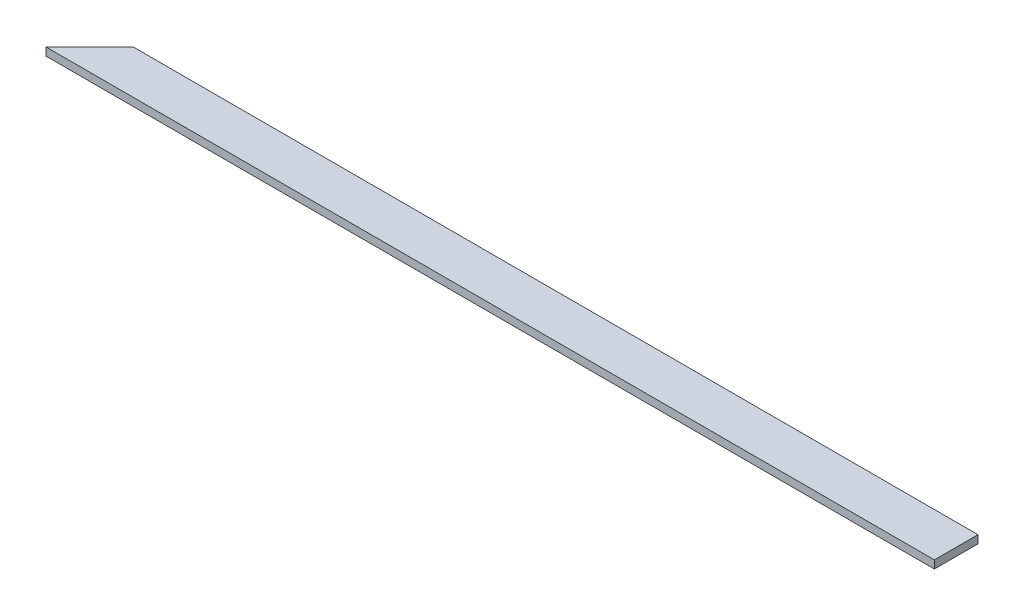
ISO-10303-21;
HEADER;
FILE_DESCRIPTION(('STEP AP214'),'2;1');
FILE_NAME('part.step','',(''),(''),'','','');
FILE_SCHEMA(('AUTOMOTIVE_DESIGN { 1 0 10303 214 1 1 1 1 }'));
ENDSEC;
DATA;
#1=APPLICATION_CONTEXT('core data for automotive mechanical design processes');
#2=APPLICATION_PROTOCOL_DEFINITION('international standard','automotive_design',2000,#1);
#3=PRODUCT_CONTEXT('',#1,'mechanical');
#4=PRODUCT('Part','Part','',(#3));
#5=PRODUCT_RELATED_PRODUCT_CATEGORY('part','',(#4));
#6=PRODUCT_DEFINITION_FORMATION('','',#4);
#7=PRODUCT_DEFINITION_CONTEXT('part definition',#1,'design');
#8=PRODUCT_DEFINITION('design','',#6,#7);
#9=PRODUCT_DEFINITION_SHAPE('','',#8);
#10=(LENGTH_UNIT() NAMED_UNIT(*) SI_UNIT(.MILLI.,.METRE.));
#11=(NAMED_UNIT(*) PLANE_ANGLE_UNIT() SI_UNIT($,.RADIAN.));
#12=(NAMED_UNIT(*) SI_UNIT($,.STERADIAN.) SOLID_ANGLE_UNIT());
#13=UNCERTAINTY_MEASURE_WITH_UNIT(LENGTH_MEASURE(1.E-05),#10,'distance_accuracy_value','');
#14=(GEOMETRIC_REPRESENTATION_CONTEXT(3) GLOBAL_UNCERTAINTY_ASSIGNED_CONTEXT((#13)) GLOBAL_UNIT_ASSIGNED_CONTEXT((#10,
#11,#12)) REPRESENTATION_CONTEXT('',''));
#15=CARTESIAN_POINT('',(0.,0.,0.));
#16=DIRECTION('',(0.,0.,1.));
#17=DIRECTION('',(1.,0.,0.));
#18=AXIS2_PLACEMENT_3D('',#15,#16,#17);
#19=CARTESIAN_POINT('',(2844.8,25.4,0.));
#20=DIRECTION('',(-1.,0.,0.));
#21=DIRECTION('',(0.,0.,1.));
#22=AXIS2_PLACEMENT_3D('',#19,#20,#21);
#23=PLANE('',#22);
#24=DIRECTION('',(0.,0.,-1.));
#25=VECTOR('',#24,1.);
#26=CARTESIAN_POINT('',(2844.8,0.,0.));
#27=LINE('',#26,#25);
#28=CARTESIAN_POINT('',(2844.8,0.,0.));
#29=VERTEX_POINT('',#28);
#30=CARTESIAN_POINT('',(2844.8,0.,-139.7));
#31=VERTEX_POINT('',#30);
#32=EDGE_CURVE('E95',#29,#31,#27,.T.);
#33=ORIENTED_EDGE('',*,*,#32,.T.);
#34=DIRECTION('',(0.,-1.,0.));
#35=VECTOR('',#34,1.);
#36=CARTESIAN_POINT('',(2844.8,25.4,-139.7));
#37=LINE('',#36,#35);
#38=CARTESIAN_POINT('',(2844.8,25.4,-139.7));
#39=VERTEX_POINT('',#38);
#40=EDGE_CURVE('E11',#39,#31,#37,.T.);
#41=ORIENTED_EDGE('',*,*,#40,.F.);
#42=DIRECTION('',(0.,0.,-1.));
#43=VECTOR('',#42,1.);
#44=CARTESIAN_POINT('',(2844.8,25.4,0.));
#45=LINE('',#44,#43);
#46=CARTESIAN_POINT('',(2844.8,25.4,0.));
#47=VERTEX_POINT('',#46);
#48=EDGE_CURVE('E80',#47,#39,#45,.T.);
#49=ORIENTED_EDGE('',*,*,#48,.F.);
#50=DIRECTION('',(0.,-1.,0.));
#51=VECTOR('',#50,1.);
#52=CARTESIAN_POINT('',(2844.8,25.4,0.));
#53=LINE('',#52,#51);
#54=EDGE_CURVE('E91',#47,#29,#53,.T.);
#55=ORIENTED_EDGE('',*,*,#54,.T.);
#56=EDGE_LOOP('',(#33,#41,#49,#55));
#57=FACE_BOUND('',#56,.T.);
#58=ADVANCED_FACE('F33',(#57),#23,.F.);
#59=CARTESIAN_POINT('',(0.,25.4,-139.7));
#60=DIRECTION('',(0.,0.,1.));
#61=DIRECTION('',(1.,0.,0.));
#62=AXIS2_PLACEMENT_3D('',#59,#60,#61);
#63=PLANE('',#62);
#64=DIRECTION('',(-1.,0.,0.));
#65=VECTOR('',#64,1.);
#66=CARTESIAN_POINT('',(0.,0.,-139.7));
#67=LINE('',#66,#65);
#68=CARTESIAN_POINT('',(139.699999999999,0.,-139.7));
#69=VERTEX_POINT('',#68);
#70=EDGE_CURVE('E85',#31,#69,#67,.T.);
#71=ORIENTED_EDGE('',*,*,#70,.T.);
#72=DIRECTION('',(0.,-1.,0.));
#73=VECTOR('',#72,1.);
#74=CARTESIAN_POINT('',(139.699999999999,25.4,-139.7));
#75=LINE('',#74,#73);
#76=CARTESIAN_POINT('',(139.699999999999,25.4,-139.7));
#77=VERTEX_POINT('',#76);
#78=EDGE_CURVE('E41',#77,#69,#75,.T.);
#79=ORIENTED_EDGE('',*,*,#78,.F.);
#80=DIRECTION('',(-1.,0.,0.));
#81=VECTOR('',#80,1.);
#82=CARTESIAN_POINT('',(0.,25.4,-139.7));
#83=LINE('',#82,#81);
#84=EDGE_CURVE('E75',#39,#77,#83,.T.);
#85=ORIENTED_EDGE('',*,*,#84,.F.);
#86=ORIENTED_EDGE('',*,*,#40,.T.);
#87=EDGE_LOOP('',(#71,#79,#85,#86));
#88=FACE_BOUND('',#87,.T.);
#89=ADVANCED_FACE('F84',(#88),#63,.F.);
#90=CARTESIAN_POINT('',(0.,25.4,0.));
#91=DIRECTION('',(-0.707106781186549,0.,-0.707106781186546));
#92=DIRECTION('',(-0.707106781186546,0.,0.707106781186549));
#93=AXIS2_PLACEMENT_3D('',#90,#91,#92);
#94=PLANE('',#93);
#95=DIRECTION('',(0.707106781186546,0.,-0.707106781186549));
#96=VECTOR('',#95,1.);
#97=CARTESIAN_POINT('',(0.,0.,0.));
#98=LINE('',#97,#96);
#99=CARTESIAN_POINT('',(0.,0.,0.));
#100=VERTEX_POINT('',#99);
#101=EDGE_CURVE('E99',#100,#69,#98,.T.);
#102=ORIENTED_EDGE('',*,*,#101,.F.);
#103=DIRECTION('',(0.,-1.,0.));
#104=VECTOR('',#103,1.);
#105=CARTESIAN_POINT('',(0.,25.4,0.));
#106=LINE('',#105,#104);
#107=CARTESIAN_POINT('',(0.,25.4,0.));
#108=VERTEX_POINT('',#107);
#109=EDGE_CURVE('E65',#108,#100,#106,.T.);
#110=ORIENTED_EDGE('',*,*,#109,.F.);
#111=DIRECTION('',(0.707106781186546,0.,-0.707106781186549));
#112=VECTOR('',#111,1.);
#113=CARTESIAN_POINT('',(0.,25.4,0.));
#114=LINE('',#113,#112);
#115=EDGE_CURVE('E78',#108,#77,#114,.T.);
#116=ORIENTED_EDGE('',*,*,#115,.T.);
#117=ORIENTED_EDGE('',*,*,#78,.T.);
#118=EDGE_LOOP('',(#102,#110,#116,#117));
#119=FACE_BOUND('',#118,.T.);
#120=ADVANCED_FACE('F89',(#119),#94,.T.);
#121=CARTESIAN_POINT('',(0.,25.4,0.));
#122=DIRECTION('',(0.,0.,-1.));
#123=DIRECTION('',(-1.,0.,0.));
#124=AXIS2_PLACEMENT_3D('',#121,#122,#123);
#125=PLANE('',#124);
#126=DIRECTION('',(1.,0.,0.));
#127=VECTOR('',#126,1.);
#128=CARTESIAN_POINT('',(0.,0.,0.));
#129=LINE('',#128,#127);
#130=EDGE_CURVE('E68',#100,#29,#129,.T.);
#131=ORIENTED_EDGE('',*,*,#130,.T.);
#132=ORIENTED_EDGE('',*,*,#54,.F.);
#133=DIRECTION('',(1.,0.,0.));
#134=VECTOR('',#133,1.);
#135=CARTESIAN_POINT('',(0.,25.4,0.));
#136=LINE('',#135,#134);
#137=EDGE_CURVE('E49',#108,#47,#136,.T.);
#138=ORIENTED_EDGE('',*,*,#137,.F.);
#139=ORIENTED_EDGE('',*,*,#109,.T.);
#140=EDGE_LOOP('',(#131,#132,#138,#139));
#141=FACE_BOUND('',#140,.T.);
#142=ADVANCED_FACE('F112',(#141),#125,.F.);
#143=CARTESIAN_POINT('',(0.,25.4,0.));
#144=DIRECTION('',(0.,1.,0.));
#145=DIRECTION('',(0.,0.,1.));
#146=AXIS2_PLACEMENT_3D('',#143,#144,#145);
#147=PLANE('',#146);
#148=ORIENTED_EDGE('',*,*,#48,.T.);
#149=ORIENTED_EDGE('',*,*,#84,.T.);
#150=ORIENTED_EDGE('',*,*,#115,.F.);
#151=ORIENTED_EDGE('',*,*,#137,.T.);
#152=EDGE_LOOP('',(#148,#149,#150,#151));
#153=FACE_BOUND('',#152,.T.);
#154=ADVANCED_FACE('F76',(#153),#147,.T.);
#155=CARTESIAN_POINT('',(0.,0.,0.));
#156=DIRECTION('',(0.,1.,0.));
#157=DIRECTION('',(0.,0.,1.));
#158=AXIS2_PLACEMENT_3D('',#155,#156,#157);
#159=PLANE('',#158);
#160=ORIENTED_EDGE('',*,*,#32,.F.);
#161=ORIENTED_EDGE('',*,*,#130,.F.);
#162=ORIENTED_EDGE('',*,*,#101,.T.);
#163=ORIENTED_EDGE('',*,*,#70,.F.);
#164=EDGE_LOOP('',(#160,#161,#162,#163));
#165=FACE_BOUND('',#164,.T.);
#166=ADVANCED_FACE('F106',(#165),#159,.F.);
#167=CLOSED_SHELL('',(#58,#89,#120,#142,#154,#166));
#168=MANIFOLD_SOLID_BREP('B2',#167);
#169=ADVANCED_BREP_SHAPE_REPRESENTATION('',(#18,#168),#14);
#170=SHAPE_DEFINITION_REPRESENTATION(#9,#169);
ENDSEC;
END-ISO-10303-21;
